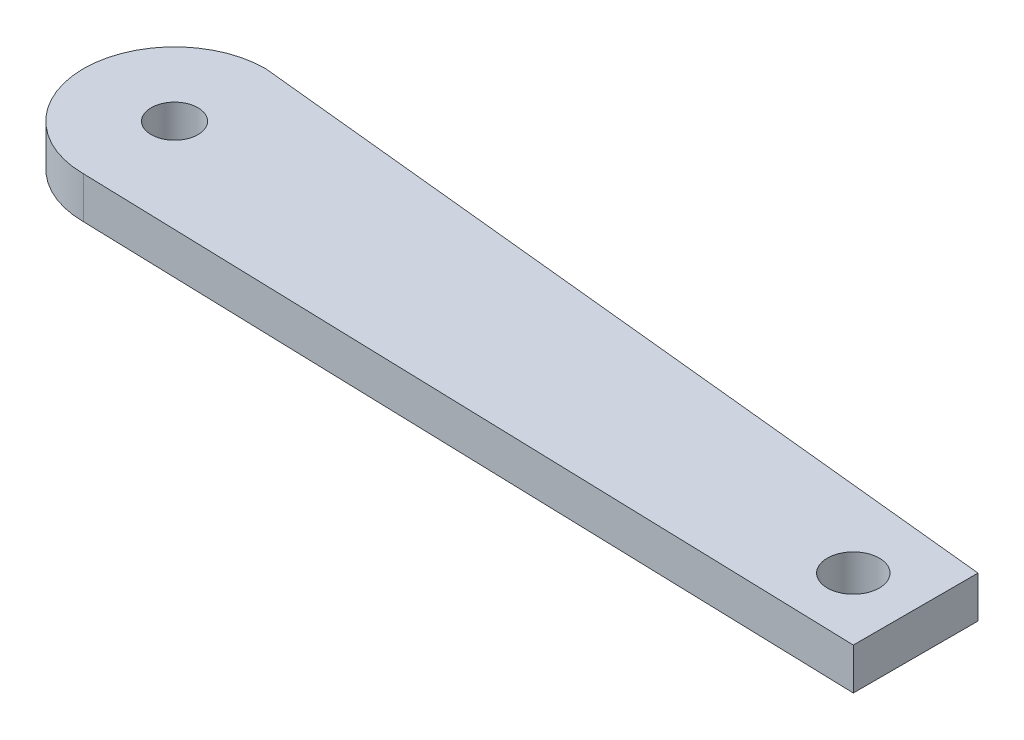
ISO-10303-21;
HEADER;
FILE_DESCRIPTION(('STEP AP214'),'2;1');
FILE_NAME('part.step','',(''),(''),'','','');
FILE_SCHEMA(('AUTOMOTIVE_DESIGN { 1 0 10303 214 1 1 1 1 }'));
ENDSEC;
DATA;
#1=APPLICATION_CONTEXT('core data for automotive mechanical design processes');
#2=APPLICATION_PROTOCOL_DEFINITION('international standard','automotive_design',2000,#1);
#3=PRODUCT_CONTEXT('',#1,'mechanical');
#4=PRODUCT('Part','Part','',(#3));
#5=PRODUCT_RELATED_PRODUCT_CATEGORY('part','',(#4));
#6=PRODUCT_DEFINITION_FORMATION('','',#4);
#7=PRODUCT_DEFINITION_CONTEXT('part definition',#1,'design');
#8=PRODUCT_DEFINITION('design','',#6,#7);
#9=PRODUCT_DEFINITION_SHAPE('','',#8);
#10=(LENGTH_UNIT() NAMED_UNIT(*) SI_UNIT(.MILLI.,.METRE.));
#11=(NAMED_UNIT(*) PLANE_ANGLE_UNIT() SI_UNIT($,.RADIAN.));
#12=(NAMED_UNIT(*) SI_UNIT($,.STERADIAN.) SOLID_ANGLE_UNIT());
#13=UNCERTAINTY_MEASURE_WITH_UNIT(LENGTH_MEASURE(1.E-05),#10,'distance_accuracy_value','');
#14=(GEOMETRIC_REPRESENTATION_CONTEXT(3) GLOBAL_UNCERTAINTY_ASSIGNED_CONTEXT((#13)) GLOBAL_UNIT_ASSIGNED_CONTEXT((#10,
#11,#12)) REPRESENTATION_CONTEXT('',''));
#15=CARTESIAN_POINT('',(0.,0.,0.));
#16=DIRECTION('',(0.,0.,1.));
#17=DIRECTION('',(1.,0.,0.));
#18=AXIS2_PLACEMENT_3D('',#15,#16,#17);
#19=CARTESIAN_POINT('',(0.88229091764949,4.,-8.6737498228792));
#20=DIRECTION('',(0.101197471739237,0.,-0.994866358720399));
#21=DIRECTION('',(-0.994866358720399,0.,-0.101197471739237));
#22=AXIS2_PLACEMENT_3D('',#19,#20,#21);
#23=PLANE('',#22);
#24=DIRECTION('',(0.994866358720399,0.,0.101197471739237));
#25=VECTOR('',#24,1.);
#26=CARTESIAN_POINT('',(0.88229091764949,0.,-8.6737498228792));
#27=LINE('',#26,#25);
#28=CARTESIAN_POINT('',(0.,0.,-8.76349615857745));
#29=VERTEX_POINT('',#28);
#30=CARTESIAN_POINT('',(76.3224715151565,0.,-1.));
#31=VERTEX_POINT('',#30);
#32=EDGE_CURVE('E105',#29,#31,#27,.T.);
#33=ORIENTED_EDGE('',*,*,#32,.F.);
#34=DIRECTION('',(0.,-1.,0.));
#35=VECTOR('',#34,1.);
#36=CARTESIAN_POINT('',(0.,4.,-8.76349615857745));
#37=LINE('',#36,#35);
#38=CARTESIAN_POINT('',(0.,4.,-8.76349615857745));
#39=VERTEX_POINT('',#38);
#40=EDGE_CURVE('E11',#39,#29,#37,.T.);
#41=ORIENTED_EDGE('',*,*,#40,.F.);
#42=DIRECTION('',(0.994866358720399,0.,0.101197471739237));
#43=VECTOR('',#42,1.);
#44=CARTESIAN_POINT('',(0.88229091764949,4.,-8.6737498228792));
#45=LINE('',#44,#43);
#46=CARTESIAN_POINT('',(76.3224715151565,4.,-1.));
#47=VERTEX_POINT('',#46);
#48=EDGE_CURVE('E84',#39,#47,#45,.T.);
#49=ORIENTED_EDGE('',*,*,#48,.T.);
#50=DIRECTION('',(0.,-1.,0.));
#51=VECTOR('',#50,1.);
#52=CARTESIAN_POINT('',(76.3224715151565,4.,-1.));
#53=LINE('',#52,#51);
#54=EDGE_CURVE('E52',#47,#31,#53,.T.);
#55=ORIENTED_EDGE('',*,*,#54,.T.);
#56=EDGE_LOOP('',(#33,#41,#49,#55));
#57=FACE_BOUND('',#56,.T.);
#58=ADVANCED_FACE('F35',(#57),#23,.T.);
#59=CARTESIAN_POINT('',(0.,4.,0.));
#60=DIRECTION('',(0.,-1.,0.));
#61=DIRECTION('',(0.,0.,-1.));
#62=AXIS2_PLACEMENT_3D('',#59,#60,#61);
#63=CYLINDRICAL_SURFACE('',#62,8.76349615857745);
#64=CARTESIAN_POINT('',(0.,0.,0.));
#65=DIRECTION('',(0.,1.,0.));
#66=DIRECTION('',(0.,0.,1.));
#67=AXIS2_PLACEMENT_3D('',#64,#65,#66);
#68=CIRCLE('',#67,8.76349615857745);
#69=CARTESIAN_POINT('',(0.,0.,8.76349615857745));
#70=VERTEX_POINT('',#69);
#71=EDGE_CURVE('E90',#29,#70,#68,.T.);
#72=ORIENTED_EDGE('',*,*,#71,.T.);
#73=DIRECTION('',(0.,-1.,0.));
#74=VECTOR('',#73,1.);
#75=CARTESIAN_POINT('',(0.,4.,8.76349615857745));
#76=LINE('',#75,#74);
#77=CARTESIAN_POINT('',(0.,4.,8.76349615857745));
#78=VERTEX_POINT('',#77);
#79=EDGE_CURVE('E44',#78,#70,#76,.T.);
#80=ORIENTED_EDGE('',*,*,#79,.F.);
#81=CARTESIAN_POINT('',(0.,4.,0.));
#82=DIRECTION('',(0.,1.,0.));
#83=DIRECTION('',(0.,0.,1.));
#84=AXIS2_PLACEMENT_3D('',#81,#82,#83);
#85=CIRCLE('',#84,8.76349615857745);
#86=EDGE_CURVE('E78',#39,#78,#85,.T.);
#87=ORIENTED_EDGE('',*,*,#86,.F.);
#88=ORIENTED_EDGE('',*,*,#40,.T.);
#89=EDGE_LOOP('',(#72,#80,#87,#88));
#90=FACE_BOUND('',#89,.T.);
#91=ADVANCED_FACE('F88',(#90),#63,.T.);
#92=CARTESIAN_POINT('',(-0.256579444755413,4.,8.75597752215971));
#93=DIRECTION('',(-0.0292907735767862,0.,0.999570933242496));
#94=DIRECTION('',(0.999570933242496,0.,0.0292907735767862));
#95=AXIS2_PLACEMENT_3D('',#92,#93,#94);
#96=PLANE('',#95);
#97=DIRECTION('',(-0.999570933242496,0.,-0.0292907735767862));
#98=VECTOR('',#97,1.);
#99=CARTESIAN_POINT('',(-0.256579444755413,0.,8.75597752215971));
#100=LINE('',#99,#98);
#101=CARTESIAN_POINT('',(76.3224715151565,0.,11.));
#102=VERTEX_POINT('',#101);
#103=EDGE_CURVE('E108',#102,#70,#100,.T.);
#104=ORIENTED_EDGE('',*,*,#103,.F.);
#105=DIRECTION('',(0.,-1.,0.));
#106=VECTOR('',#105,1.);
#107=CARTESIAN_POINT('',(76.3224715151565,4.,11.));
#108=LINE('',#107,#106);
#109=CARTESIAN_POINT('',(76.3224715151565,4.,11.));
#110=VERTEX_POINT('',#109);
#111=EDGE_CURVE('E65',#110,#102,#108,.T.);
#112=ORIENTED_EDGE('',*,*,#111,.F.);
#113=DIRECTION('',(-0.999570933242496,0.,-0.0292907735767862));
#114=VECTOR('',#113,1.);
#115=CARTESIAN_POINT('',(-0.256579444755413,4.,8.75597752215971));
#116=LINE('',#115,#114);
#117=EDGE_CURVE('E83',#110,#78,#116,.T.);
#118=ORIENTED_EDGE('',*,*,#117,.T.);
#119=ORIENTED_EDGE('',*,*,#79,.T.);
#120=EDGE_LOOP('',(#104,#112,#118,#119));
#121=FACE_BOUND('',#120,.T.);
#122=ADVANCED_FACE('F93',(#121),#96,.T.);
#123=CARTESIAN_POINT('',(70.3224715151565,4.,5.));
#124=DIRECTION('',(0.,-1.,0.));
#125=DIRECTION('',(0.,0.,-1.));
#126=AXIS2_PLACEMENT_3D('',#123,#124,#125);
#127=CYLINDRICAL_SURFACE('',#126,2.49999999999999);
#128=CARTESIAN_POINT('',(70.3224715151565,4.,5.));
#129=DIRECTION('',(0.,1.,0.));
#130=DIRECTION('',(0.,0.,1.));
#131=AXIS2_PLACEMENT_3D('',#128,#129,#130);
#132=CIRCLE('',#131,2.49999999999999);
#133=CARTESIAN_POINT('',(70.3224715151565,4.,7.49999999999999));
#134=VERTEX_POINT('',#133);
#135=EDGE_CURVE('E117',#134,#134,#132,.T.);
#136=ORIENTED_EDGE('',*,*,#135,.T.);
#137=EDGE_LOOP('',(#136));
#138=FACE_BOUND('',#137,.T.);
#139=CARTESIAN_POINT('',(70.3224715151565,0.,5.));
#140=DIRECTION('',(0.,1.,0.));
#141=DIRECTION('',(0.,0.,1.));
#142=AXIS2_PLACEMENT_3D('',#139,#140,#141);
#143=CIRCLE('',#142,2.49999999999999);
#144=CARTESIAN_POINT('',(70.3224715151565,0.,7.49999999999999));
#145=VERTEX_POINT('',#144);
#146=EDGE_CURVE('E102',#145,#145,#143,.T.);
#147=ORIENTED_EDGE('',*,*,#146,.F.);
#148=EDGE_LOOP('',(#147));
#149=FACE_BOUND('',#148,.T.);
#150=ADVANCED_FACE('F133',(#138,#149),#127,.F.);
#151=CARTESIAN_POINT('',(0.,4.,0.));
#152=DIRECTION('',(0.,-1.,0.));
#153=DIRECTION('',(0.,0.,-1.));
#154=AXIS2_PLACEMENT_3D('',#151,#152,#153);
#155=CYLINDRICAL_SURFACE('',#154,2.25);
#156=CARTESIAN_POINT('',(0.,4.,0.));
#157=DIRECTION('',(0.,1.,0.));
#158=DIRECTION('',(0.,0.,1.));
#159=AXIS2_PLACEMENT_3D('',#156,#157,#158);
#160=CIRCLE('',#159,2.25);
#161=CARTESIAN_POINT('',(0.,4.,2.25));
#162=VERTEX_POINT('',#161);
#163=EDGE_CURVE('E113',#162,#162,#160,.T.);
#164=ORIENTED_EDGE('',*,*,#163,.T.);
#165=EDGE_LOOP('',(#164));
#166=FACE_BOUND('',#165,.T.);
#167=CARTESIAN_POINT('',(0.,0.,0.));
#168=DIRECTION('',(0.,1.,0.));
#169=DIRECTION('',(0.,0.,1.));
#170=AXIS2_PLACEMENT_3D('',#167,#168,#169);
#171=CIRCLE('',#170,2.25);
#172=CARTESIAN_POINT('',(0.,0.,2.25));
#173=VERTEX_POINT('',#172);
#174=EDGE_CURVE('E99',#173,#173,#171,.T.);
#175=ORIENTED_EDGE('',*,*,#174,.F.);
#176=EDGE_LOOP('',(#175));
#177=FACE_BOUND('',#176,.T.);
#178=ADVANCED_FACE('F37',(#166,#177),#155,.F.);
#179=CARTESIAN_POINT('',(76.3224715151565,4.,0.));
#180=DIRECTION('',(1.,0.,0.));
#181=DIRECTION('',(0.,0.,-1.));
#182=AXIS2_PLACEMENT_3D('',#179,#180,#181);
#183=PLANE('',#182);
#184=DIRECTION('',(0.,0.,1.));
#185=VECTOR('',#184,1.);
#186=CARTESIAN_POINT('',(76.3224715151565,0.,0.));
#187=LINE('',#186,#185);
#188=EDGE_CURVE('E110',#31,#102,#187,.T.);
#189=ORIENTED_EDGE('',*,*,#188,.F.);
#190=ORIENTED_EDGE('',*,*,#54,.F.);
#191=DIRECTION('',(0.,0.,1.));
#192=VECTOR('',#191,1.);
#193=CARTESIAN_POINT('',(76.3224715151565,4.,0.));
#194=LINE('',#193,#192);
#195=EDGE_CURVE('E94',#47,#110,#194,.T.);
#196=ORIENTED_EDGE('',*,*,#195,.T.);
#197=ORIENTED_EDGE('',*,*,#111,.T.);
#198=EDGE_LOOP('',(#189,#190,#196,#197));
#199=FACE_BOUND('',#198,.T.);
#200=ADVANCED_FACE('F123',(#199),#183,.T.);
#201=CARTESIAN_POINT('',(0.,4.,0.));
#202=DIRECTION('',(0.,1.,0.));
#203=DIRECTION('',(0.,0.,1.));
#204=AXIS2_PLACEMENT_3D('',#201,#202,#203);
#205=PLANE('',#204);
#206=ORIENTED_EDGE('',*,*,#163,.F.);
#207=EDGE_LOOP('',(#206));
#208=FACE_BOUND('',#207,.T.);
#209=ORIENTED_EDGE('',*,*,#135,.F.);
#210=EDGE_LOOP('',(#209));
#211=FACE_BOUND('',#210,.T.);
#212=ORIENTED_EDGE('',*,*,#48,.F.);
#213=ORIENTED_EDGE('',*,*,#86,.T.);
#214=ORIENTED_EDGE('',*,*,#117,.F.);
#215=ORIENTED_EDGE('',*,*,#195,.F.);
#216=EDGE_LOOP('',(#212,#213,#214,#215));
#217=FACE_BOUND('',#216,.T.);
#218=ADVANCED_FACE('F80',(#208,#211,#217),#205,.T.);
#219=CARTESIAN_POINT('',(0.,0.,0.));
#220=DIRECTION('',(0.,1.,0.));
#221=DIRECTION('',(0.,0.,1.));
#222=AXIS2_PLACEMENT_3D('',#219,#220,#221);
#223=PLANE('',#222);
#224=ORIENTED_EDGE('',*,*,#174,.T.);
#225=EDGE_LOOP('',(#224));
#226=FACE_BOUND('',#225,.T.);
#227=ORIENTED_EDGE('',*,*,#146,.T.);
#228=EDGE_LOOP('',(#227));
#229=FACE_BOUND('',#228,.T.);
#230=ORIENTED_EDGE('',*,*,#32,.T.);
#231=ORIENTED_EDGE('',*,*,#188,.T.);
#232=ORIENTED_EDGE('',*,*,#103,.T.);
#233=ORIENTED_EDGE('',*,*,#71,.F.);
#234=EDGE_LOOP('',(#230,#231,#232,#233));
#235=FACE_BOUND('',#234,.T.);
#236=ADVANCED_FACE('F130',(#226,#229,#235),#223,.F.);
#237=CLOSED_SHELL('',(#58,#91,#122,#150,#178,#200,#218,#236));
#238=MANIFOLD_SOLID_BREP('B2',#237);
#239=ADVANCED_BREP_SHAPE_REPRESENTATION('',(#18,#238),#14);
#240=SHAPE_DEFINITION_REPRESENTATION(#9,#239);
ENDSEC;
END-ISO-10303-21;
